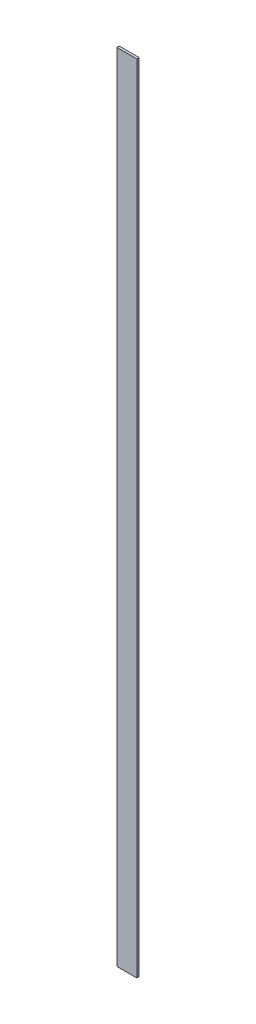
ISO-10303-21;
HEADER;
FILE_DESCRIPTION(('STEP AP214'),'2;1');
FILE_NAME('part.step','',(''),(''),'','','');
FILE_SCHEMA(('AUTOMOTIVE_DESIGN { 1 0 10303 214 1 1 1 1 }'));
ENDSEC;
DATA;
#1=APPLICATION_CONTEXT('core data for automotive mechanical design processes');
#2=APPLICATION_PROTOCOL_DEFINITION('international standard','automotive_design',2000,#1);
#3=PRODUCT_CONTEXT('',#1,'mechanical');
#4=PRODUCT('Part','Part','',(#3));
#5=PRODUCT_RELATED_PRODUCT_CATEGORY('part','',(#4));
#6=PRODUCT_DEFINITION_FORMATION('','',#4);
#7=PRODUCT_DEFINITION_CONTEXT('part definition',#1,'design');
#8=PRODUCT_DEFINITION('design','',#6,#7);
#9=PRODUCT_DEFINITION_SHAPE('','',#8);
#10=(LENGTH_UNIT() NAMED_UNIT(*) SI_UNIT(.MILLI.,.METRE.));
#11=(NAMED_UNIT(*) PLANE_ANGLE_UNIT() SI_UNIT($,.RADIAN.));
#12=(NAMED_UNIT(*) SI_UNIT($,.STERADIAN.) SOLID_ANGLE_UNIT());
#13=UNCERTAINTY_MEASURE_WITH_UNIT(LENGTH_MEASURE(1.E-05),#10,'distance_accuracy_value','');
#14=(GEOMETRIC_REPRESENTATION_CONTEXT(3) GLOBAL_UNCERTAINTY_ASSIGNED_CONTEXT((#13)) GLOBAL_UNIT_ASSIGNED_CONTEXT((#10,
#11,#12)) REPRESENTATION_CONTEXT('',''));
#15=CARTESIAN_POINT('',(0.,0.,0.));
#16=DIRECTION('',(0.,0.,1.));
#17=DIRECTION('',(1.,0.,0.));
#18=AXIS2_PLACEMENT_3D('',#15,#16,#17);
#19=CARTESIAN_POINT('',(2.5,-100.,0.6));
#20=DIRECTION('',(-1.,0.,0.));
#21=DIRECTION('',(0.,0.,1.));
#22=AXIS2_PLACEMENT_3D('',#19,#20,#21);
#23=PLANE('',#22);
#24=DIRECTION('',(0.,1.,0.));
#25=VECTOR('',#24,1.);
#26=CARTESIAN_POINT('',(2.5,-100.,0.));
#27=LINE('',#26,#25);
#28=CARTESIAN_POINT('',(2.5,-100.,0.));
#29=VERTEX_POINT('',#28);
#30=CARTESIAN_POINT('',(2.5,100.,0.));
#31=VERTEX_POINT('',#30);
#32=EDGE_CURVE('E100',#29,#31,#27,.T.);
#33=ORIENTED_EDGE('',*,*,#32,.T.);
#34=DIRECTION('',(0.,0.,-1.));
#35=VECTOR('',#34,1.);
#36=CARTESIAN_POINT('',(2.5,100.,0.6));
#37=LINE('',#36,#35);
#38=CARTESIAN_POINT('',(2.5,100.,0.6));
#39=VERTEX_POINT('',#38);
#40=EDGE_CURVE('E11',#39,#31,#37,.T.);
#41=ORIENTED_EDGE('',*,*,#40,.F.);
#42=DIRECTION('',(0.,1.,0.));
#43=VECTOR('',#42,1.);
#44=CARTESIAN_POINT('',(2.5,-100.,0.6));
#45=LINE('',#44,#43);
#46=CARTESIAN_POINT('',(2.5,-100.,0.6));
#47=VERTEX_POINT('',#46);
#48=EDGE_CURVE('E88',#47,#39,#45,.T.);
#49=ORIENTED_EDGE('',*,*,#48,.F.);
#50=DIRECTION('',(0.,0.,-1.));
#51=VECTOR('',#50,1.);
#52=CARTESIAN_POINT('',(2.5,-100.,0.6));
#53=LINE('',#52,#51);
#54=EDGE_CURVE('E96',#47,#29,#53,.T.);
#55=ORIENTED_EDGE('',*,*,#54,.T.);
#56=EDGE_LOOP('',(#33,#41,#49,#55));
#57=FACE_BOUND('',#56,.T.);
#58=ADVANCED_FACE('F37',(#57),#23,.F.);
#59=CARTESIAN_POINT('',(-2.5,100.,0.6));
#60=DIRECTION('',(0.,-1.,0.));
#61=DIRECTION('',(0.,0.,-1.));
#62=AXIS2_PLACEMENT_3D('',#59,#60,#61);
#63=PLANE('',#62);
#64=DIRECTION('',(-1.,0.,0.));
#65=VECTOR('',#64,1.);
#66=CARTESIAN_POINT('',(-2.5,100.,0.));
#67=LINE('',#66,#65);
#68=CARTESIAN_POINT('',(-2.5,100.,0.));
#69=VERTEX_POINT('',#68);
#70=EDGE_CURVE('E92',#31,#69,#67,.T.);
#71=ORIENTED_EDGE('',*,*,#70,.T.);
#72=DIRECTION('',(0.,0.,-1.));
#73=VECTOR('',#72,1.);
#74=CARTESIAN_POINT('',(-2.5,100.,0.6));
#75=LINE('',#74,#73);
#76=CARTESIAN_POINT('',(-2.5,100.,0.6));
#77=VERTEX_POINT('',#76);
#78=EDGE_CURVE('E45',#77,#69,#75,.T.);
#79=ORIENTED_EDGE('',*,*,#78,.F.);
#80=DIRECTION('',(-1.,0.,0.));
#81=VECTOR('',#80,1.);
#82=CARTESIAN_POINT('',(-2.5,100.,0.6));
#83=LINE('',#82,#81);
#84=EDGE_CURVE('E83',#39,#77,#83,.T.);
#85=ORIENTED_EDGE('',*,*,#84,.F.);
#86=ORIENTED_EDGE('',*,*,#40,.T.);
#87=EDGE_LOOP('',(#71,#79,#85,#86));
#88=FACE_BOUND('',#87,.T.);
#89=ADVANCED_FACE('F91',(#88),#63,.F.);
#90=CARTESIAN_POINT('',(-2.5,-100.,0.6));
#91=DIRECTION('',(1.,0.,0.));
#92=DIRECTION('',(0.,0.,-1.));
#93=AXIS2_PLACEMENT_3D('',#90,#91,#92);
#94=PLANE('',#93);
#95=DIRECTION('',(0.,-1.,0.));
#96=VECTOR('',#95,1.);
#97=CARTESIAN_POINT('',(-2.5,-100.,0.));
#98=LINE('',#97,#96);
#99=CARTESIAN_POINT('',(-2.5,-100.,0.));
#100=VERTEX_POINT('',#99);
#101=EDGE_CURVE('E70',#69,#100,#98,.T.);
#102=ORIENTED_EDGE('',*,*,#101,.T.);
#103=DIRECTION('',(0.,0.,-1.));
#104=VECTOR('',#103,1.);
#105=CARTESIAN_POINT('',(-2.5,-100.,0.6));
#106=LINE('',#105,#104);
#107=CARTESIAN_POINT('',(-2.5,-100.,0.6));
#108=VERTEX_POINT('',#107);
#109=EDGE_CURVE('E93',#108,#100,#106,.T.);
#110=ORIENTED_EDGE('',*,*,#109,.F.);
#111=DIRECTION('',(0.,-1.,0.));
#112=VECTOR('',#111,1.);
#113=CARTESIAN_POINT('',(-2.5,-100.,0.6));
#114=LINE('',#113,#112);
#115=EDGE_CURVE('E86',#77,#108,#114,.T.);
#116=ORIENTED_EDGE('',*,*,#115,.F.);
#117=ORIENTED_EDGE('',*,*,#78,.T.);
#118=EDGE_LOOP('',(#102,#110,#116,#117));
#119=FACE_BOUND('',#118,.T.);
#120=ADVANCED_FACE('F94',(#119),#94,.F.);
#121=CARTESIAN_POINT('',(-2.5,-100.,0.6));
#122=DIRECTION('',(0.,1.,0.));
#123=DIRECTION('',(0.,0.,1.));
#124=AXIS2_PLACEMENT_3D('',#121,#122,#123);
#125=PLANE('',#124);
#126=DIRECTION('',(1.,0.,0.));
#127=VECTOR('',#126,1.);
#128=CARTESIAN_POINT('',(-2.5,-100.,0.));
#129=LINE('',#128,#127);
#130=EDGE_CURVE('E76',#100,#29,#129,.T.);
#131=ORIENTED_EDGE('',*,*,#130,.T.);
#132=ORIENTED_EDGE('',*,*,#54,.F.);
#133=DIRECTION('',(1.,0.,0.));
#134=VECTOR('',#133,1.);
#135=CARTESIAN_POINT('',(-2.5,-100.,0.6));
#136=LINE('',#135,#134);
#137=EDGE_CURVE('E53',#108,#47,#136,.T.);
#138=ORIENTED_EDGE('',*,*,#137,.F.);
#139=ORIENTED_EDGE('',*,*,#109,.T.);
#140=EDGE_LOOP('',(#131,#132,#138,#139));
#141=FACE_BOUND('',#140,.T.);
#142=ADVANCED_FACE('F107',(#141),#125,.F.);
#143=CARTESIAN_POINT('',(0.,0.,0.6));
#144=DIRECTION('',(0.,0.,-1.));
#145=DIRECTION('',(-1.,0.,0.));
#146=AXIS2_PLACEMENT_3D('',#143,#144,#145);
#147=PLANE('',#146);
#148=ORIENTED_EDGE('',*,*,#48,.T.);
#149=ORIENTED_EDGE('',*,*,#84,.T.);
#150=ORIENTED_EDGE('',*,*,#115,.T.);
#151=ORIENTED_EDGE('',*,*,#137,.T.);
#152=EDGE_LOOP('',(#148,#149,#150,#151));
#153=FACE_BOUND('',#152,.T.);
#154=ADVANCED_FACE('F84',(#153),#147,.F.);
#155=CARTESIAN_POINT('',(0.,0.,0.));
#156=DIRECTION('',(0.,0.,-1.));
#157=DIRECTION('',(-1.,0.,0.));
#158=AXIS2_PLACEMENT_3D('',#155,#156,#157);
#159=PLANE('',#158);
#160=ORIENTED_EDGE('',*,*,#32,.F.);
#161=ORIENTED_EDGE('',*,*,#130,.F.);
#162=ORIENTED_EDGE('',*,*,#101,.F.);
#163=ORIENTED_EDGE('',*,*,#70,.F.);
#164=EDGE_LOOP('',(#160,#161,#162,#163));
#165=FACE_BOUND('',#164,.T.);
#166=ADVANCED_FACE('F110',(#165),#159,.T.);
#167=CLOSED_SHELL('',(#58,#89,#120,#142,#154,#166));
#168=MANIFOLD_SOLID_BREP('B2',#167);
#169=ADVANCED_BREP_SHAPE_REPRESENTATION('',(#18,#168),#14);
#170=SHAPE_DEFINITION_REPRESENTATION(#9,#169);
ENDSEC;
END-ISO-10303-21;
